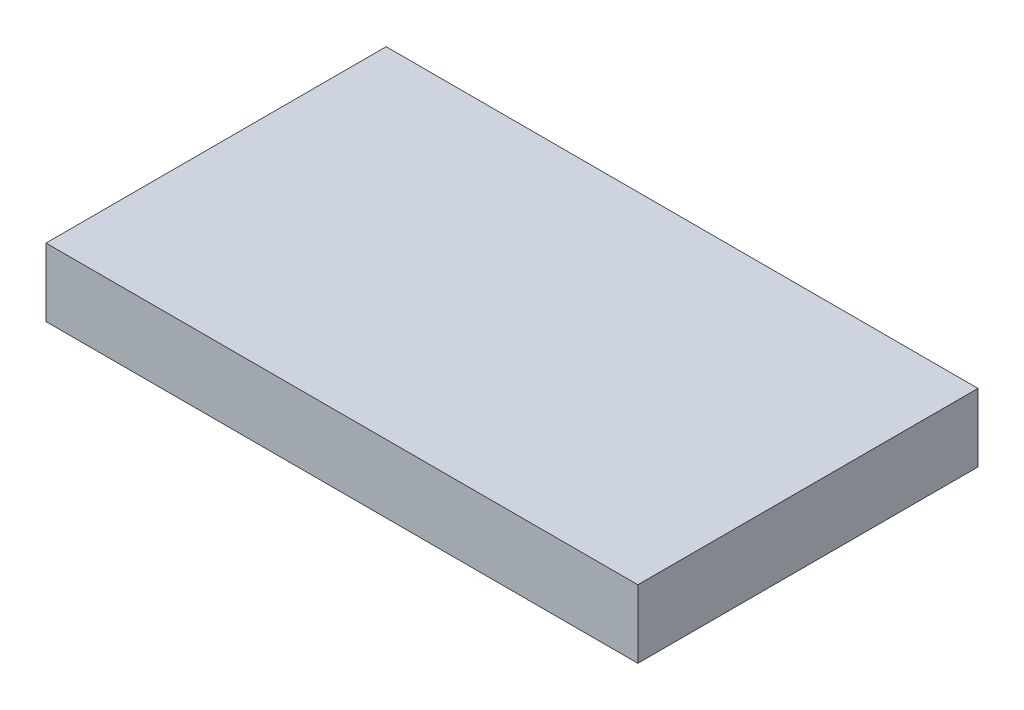
ISO-10303-21;
HEADER;
FILE_DESCRIPTION(('STEP AP214'),'2;1');
FILE_NAME('part.step','',(''),(''),'','','');
FILE_SCHEMA(('AUTOMOTIVE_DESIGN { 1 0 10303 214 1 1 1 1 }'));
ENDSEC;
DATA;
#1=APPLICATION_CONTEXT('core data for automotive mechanical design processes');
#2=APPLICATION_PROTOCOL_DEFINITION('international standard','automotive_design',2000,#1);
#3=PRODUCT_CONTEXT('',#1,'mechanical');
#4=PRODUCT('Part','Part','',(#3));
#5=PRODUCT_RELATED_PRODUCT_CATEGORY('part','',(#4));
#6=PRODUCT_DEFINITION_FORMATION('','',#4);
#7=PRODUCT_DEFINITION_CONTEXT('part definition',#1,'design');
#8=PRODUCT_DEFINITION('design','',#6,#7);
#9=PRODUCT_DEFINITION_SHAPE('','',#8);
#10=(LENGTH_UNIT() NAMED_UNIT(*) SI_UNIT(.MILLI.,.METRE.));
#11=(NAMED_UNIT(*) PLANE_ANGLE_UNIT() SI_UNIT($,.RADIAN.));
#12=(NAMED_UNIT(*) SI_UNIT($,.STERADIAN.) SOLID_ANGLE_UNIT());
#13=UNCERTAINTY_MEASURE_WITH_UNIT(LENGTH_MEASURE(1.E-05),#10,'distance_accuracy_value','');
#14=(GEOMETRIC_REPRESENTATION_CONTEXT(3) GLOBAL_UNCERTAINTY_ASSIGNED_CONTEXT((#13)) GLOBAL_UNIT_ASSIGNED_CONTEXT((#10,
#11,#12)) REPRESENTATION_CONTEXT('',''));
#15=CARTESIAN_POINT('',(0.,0.,0.));
#16=DIRECTION('',(0.,0.,1.));
#17=DIRECTION('',(1.,0.,0.));
#18=AXIS2_PLACEMENT_3D('',#15,#16,#17);
#19=CARTESIAN_POINT('',(0.,10.,0.));
#20=DIRECTION('',(0.,1.,0.));
#21=DIRECTION('',(0.,0.,1.));
#22=AXIS2_PLACEMENT_3D('',#19,#20,#21);
#23=PLANE('',#22);
#24=DIRECTION('',(-1.,0.,0.));
#25=VECTOR('',#24,1.);
#26=CARTESIAN_POINT('',(43.5,10.,-25.));
#27=LINE('',#26,#25);
#28=CARTESIAN_POINT('',(-43.5,10.,-25.));
#29=VERTEX_POINT('',#28);
#30=CARTESIAN_POINT('',(43.5,10.,-25.));
#31=VERTEX_POINT('',#30);
#32=EDGE_CURVE('E68',#29,#31,#27,.F.);
#33=ORIENTED_EDGE('',*,*,#32,.F.);
#34=DIRECTION('',(0.,0.,1.));
#35=VECTOR('',#34,1.);
#36=CARTESIAN_POINT('',(-43.5,10.,-25.));
#37=LINE('',#36,#35);
#38=CARTESIAN_POINT('',(-43.5,10.,25.));
#39=VERTEX_POINT('',#38);
#40=EDGE_CURVE('E20',#39,#29,#37,.F.);
#41=ORIENTED_EDGE('',*,*,#40,.F.);
#42=DIRECTION('',(1.,0.,0.));
#43=VECTOR('',#42,1.);
#44=CARTESIAN_POINT('',(-43.5,10.,25.));
#45=LINE('',#44,#43);
#46=CARTESIAN_POINT('',(43.5,10.,25.));
#47=VERTEX_POINT('',#46);
#48=EDGE_CURVE('E58',#47,#39,#45,.F.);
#49=ORIENTED_EDGE('',*,*,#48,.F.);
#50=DIRECTION('',(0.,0.,-1.));
#51=VECTOR('',#50,1.);
#52=CARTESIAN_POINT('',(43.5,10.,25.));
#53=LINE('',#52,#51);
#54=EDGE_CURVE('E53',#31,#47,#53,.F.);
#55=ORIENTED_EDGE('',*,*,#54,.F.);
#56=EDGE_LOOP('',(#33,#41,#49,#55));
#57=FACE_BOUND('',#56,.T.);
#58=ADVANCED_FACE('F17',(#57),#23,.T.);
#59=CARTESIAN_POINT('',(-43.5,0.,-25.));
#60=DIRECTION('',(-1.,0.,0.));
#61=DIRECTION('',(0.,0.,1.));
#62=AXIS2_PLACEMENT_3D('',#59,#60,#61);
#63=PLANE('',#62);
#64=DIRECTION('',(0.,1.,0.));
#65=VECTOR('',#64,1.);
#66=CARTESIAN_POINT('',(-43.5,0.,-25.));
#67=LINE('',#66,#65);
#68=CARTESIAN_POINT('',(-43.5,0.,-25.));
#69=VERTEX_POINT('',#68);
#70=EDGE_CURVE('E79',#69,#29,#67,.T.);
#71=ORIENTED_EDGE('',*,*,#70,.F.);
#72=DIRECTION('',(0.,0.,1.));
#73=VECTOR('',#72,1.);
#74=CARTESIAN_POINT('',(-43.5,0.,0.));
#75=LINE('',#74,#73);
#76=CARTESIAN_POINT('',(-43.5,0.,25.));
#77=VERTEX_POINT('',#76);
#78=EDGE_CURVE('E74',#69,#77,#75,.T.);
#79=ORIENTED_EDGE('',*,*,#78,.T.);
#80=DIRECTION('',(0.,1.,0.));
#81=VECTOR('',#80,1.);
#82=CARTESIAN_POINT('',(-43.5,0.,25.));
#83=LINE('',#82,#81);
#84=EDGE_CURVE('E63',#39,#77,#83,.F.);
#85=ORIENTED_EDGE('',*,*,#84,.F.);
#86=ORIENTED_EDGE('',*,*,#40,.T.);
#87=EDGE_LOOP('',(#71,#79,#85,#86));
#88=FACE_BOUND('',#87,.T.);
#89=ADVANCED_FACE('F73',(#88),#63,.T.);
#90=CARTESIAN_POINT('',(-43.5,0.,25.));
#91=DIRECTION('',(0.,0.,1.));
#92=DIRECTION('',(1.,0.,0.));
#93=AXIS2_PLACEMENT_3D('',#90,#91,#92);
#94=PLANE('',#93);
#95=ORIENTED_EDGE('',*,*,#84,.T.);
#96=DIRECTION('',(1.,0.,0.));
#97=VECTOR('',#96,1.);
#98=CARTESIAN_POINT('',(0.,0.,25.));
#99=LINE('',#98,#97);
#100=CARTESIAN_POINT('',(43.5,0.,25.));
#101=VERTEX_POINT('',#100);
#102=EDGE_CURVE('E84',#77,#101,#99,.T.);
#103=ORIENTED_EDGE('',*,*,#102,.T.);
#104=DIRECTION('',(0.,1.,0.));
#105=VECTOR('',#104,1.);
#106=CARTESIAN_POINT('',(43.5,0.,25.));
#107=LINE('',#106,#105);
#108=EDGE_CURVE('E65',#47,#101,#107,.F.);
#109=ORIENTED_EDGE('',*,*,#108,.F.);
#110=ORIENTED_EDGE('',*,*,#48,.T.);
#111=EDGE_LOOP('',(#95,#103,#109,#110));
#112=FACE_BOUND('',#111,.T.);
#113=ADVANCED_FACE('F60',(#112),#94,.T.);
#114=CARTESIAN_POINT('',(43.5,0.,25.));
#115=DIRECTION('',(1.,0.,0.));
#116=DIRECTION('',(0.,0.,-1.));
#117=AXIS2_PLACEMENT_3D('',#114,#115,#116);
#118=PLANE('',#117);
#119=ORIENTED_EDGE('',*,*,#108,.T.);
#120=DIRECTION('',(0.,0.,1.));
#121=VECTOR('',#120,1.);
#122=CARTESIAN_POINT('',(43.5,0.,0.));
#123=LINE('',#122,#121);
#124=CARTESIAN_POINT('',(43.5,0.,-25.));
#125=VERTEX_POINT('',#124);
#126=EDGE_CURVE('E26',#101,#125,#123,.F.);
#127=ORIENTED_EDGE('',*,*,#126,.T.);
#128=DIRECTION('',(0.,1.,0.));
#129=VECTOR('',#128,1.);
#130=CARTESIAN_POINT('',(43.5,0.,-25.));
#131=LINE('',#130,#129);
#132=EDGE_CURVE('E34',#31,#125,#131,.F.);
#133=ORIENTED_EDGE('',*,*,#132,.F.);
#134=ORIENTED_EDGE('',*,*,#54,.T.);
#135=EDGE_LOOP('',(#119,#127,#133,#134));
#136=FACE_BOUND('',#135,.T.);
#137=ADVANCED_FACE('F88',(#136),#118,.T.);
#138=CARTESIAN_POINT('',(43.5,0.,-25.));
#139=DIRECTION('',(0.,0.,-1.));
#140=DIRECTION('',(-1.,0.,0.));
#141=AXIS2_PLACEMENT_3D('',#138,#139,#140);
#142=PLANE('',#141);
#143=ORIENTED_EDGE('',*,*,#132,.T.);
#144=DIRECTION('',(1.,0.,0.));
#145=VECTOR('',#144,1.);
#146=CARTESIAN_POINT('',(0.,0.,-25.));
#147=LINE('',#146,#145);
#148=EDGE_CURVE('E11',#125,#69,#147,.F.);
#149=ORIENTED_EDGE('',*,*,#148,.T.);
#150=ORIENTED_EDGE('',*,*,#70,.T.);
#151=ORIENTED_EDGE('',*,*,#32,.T.);
#152=EDGE_LOOP('',(#143,#149,#150,#151));
#153=FACE_BOUND('',#152,.T.);
#154=ADVANCED_FACE('F91',(#153),#142,.T.);
#155=CARTESIAN_POINT('',(0.,0.,0.));
#156=DIRECTION('',(0.,1.,0.));
#157=DIRECTION('',(0.,0.,1.));
#158=AXIS2_PLACEMENT_3D('',#155,#156,#157);
#159=PLANE('',#158);
#160=ORIENTED_EDGE('',*,*,#126,.F.);
#161=ORIENTED_EDGE('',*,*,#102,.F.);
#162=ORIENTED_EDGE('',*,*,#78,.F.);
#163=ORIENTED_EDGE('',*,*,#148,.F.);
#164=EDGE_LOOP('',(#160,#161,#162,#163));
#165=FACE_BOUND('',#164,.T.);
#166=ADVANCED_FACE('F90',(#165),#159,.F.);
#167=CLOSED_SHELL('',(#58,#89,#113,#137,#154,#166));
#168=MANIFOLD_SOLID_BREP('B1',#167);
#169=ADVANCED_BREP_SHAPE_REPRESENTATION('',(#18,#168),#14);
#170=SHAPE_DEFINITION_REPRESENTATION(#9,#169);
ENDSEC;
END-ISO-10303-21;
